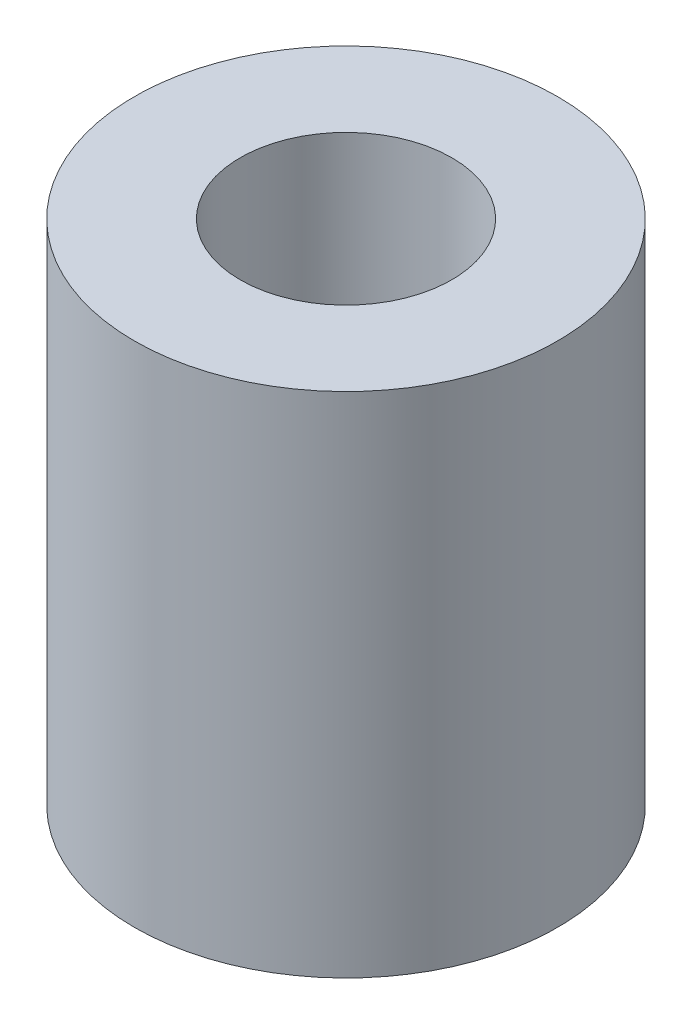
ISO-10303-21;
HEADER;
FILE_DESCRIPTION(('STEP AP214'),'2;1');
FILE_NAME('part.step','',(''),(''),'','','');
FILE_SCHEMA(('AUTOMOTIVE_DESIGN { 1 0 10303 214 1 1 1 1 }'));
ENDSEC;
DATA;
#1=APPLICATION_CONTEXT('core data for automotive mechanical design processes');
#2=APPLICATION_PROTOCOL_DEFINITION('international standard','automotive_design',2000,#1);
#3=PRODUCT_CONTEXT('',#1,'mechanical');
#4=PRODUCT('Part','Part','',(#3));
#5=PRODUCT_RELATED_PRODUCT_CATEGORY('part','',(#4));
#6=PRODUCT_DEFINITION_FORMATION('','',#4);
#7=PRODUCT_DEFINITION_CONTEXT('part definition',#1,'design');
#8=PRODUCT_DEFINITION('design','',#6,#7);
#9=PRODUCT_DEFINITION_SHAPE('','',#8);
#10=(LENGTH_UNIT() NAMED_UNIT(*) SI_UNIT(.MILLI.,.METRE.));
#11=(NAMED_UNIT(*) PLANE_ANGLE_UNIT() SI_UNIT($,.RADIAN.));
#12=(NAMED_UNIT(*) SI_UNIT($,.STERADIAN.) SOLID_ANGLE_UNIT());
#13=UNCERTAINTY_MEASURE_WITH_UNIT(LENGTH_MEASURE(1.E-05),#10,'distance_accuracy_value','');
#14=(GEOMETRIC_REPRESENTATION_CONTEXT(3) GLOBAL_UNCERTAINTY_ASSIGNED_CONTEXT((#13)) GLOBAL_UNIT_ASSIGNED_CONTEXT((#10,
#11,#12)) REPRESENTATION_CONTEXT('',''));
#15=CARTESIAN_POINT('',(0.,0.,0.));
#16=DIRECTION('',(0.,0.,1.));
#17=DIRECTION('',(1.,0.,0.));
#18=AXIS2_PLACEMENT_3D('',#15,#16,#17);
#19=CARTESIAN_POINT('',(0.,24.,0.));
#20=DIRECTION('',(0.,-1.,0.));
#21=DIRECTION('',(0.,0.,-1.));
#22=AXIS2_PLACEMENT_3D('',#19,#20,#21);
#23=CYLINDRICAL_SURFACE('',#22,10.);
#24=CARTESIAN_POINT('',(0.,24.,0.));
#25=DIRECTION('',(0.,1.,0.));
#26=DIRECTION('',(0.,0.,1.));
#27=AXIS2_PLACEMENT_3D('',#24,#25,#26);
#28=CIRCLE('',#27,10.);
#29=CARTESIAN_POINT('',(0.,24.,10.));
#30=VERTEX_POINT('',#29);
#31=EDGE_CURVE('E10',#30,#30,#28,.T.);
#32=ORIENTED_EDGE('',*,*,#31,.F.);
#33=EDGE_LOOP('',(#32));
#34=FACE_BOUND('',#33,.T.);
#35=CARTESIAN_POINT('',(0.,0.,0.));
#36=DIRECTION('',(0.,1.,0.));
#37=DIRECTION('',(0.,0.,1.));
#38=AXIS2_PLACEMENT_3D('',#35,#36,#37);
#39=CIRCLE('',#38,10.);
#40=CARTESIAN_POINT('',(0.,0.,10.));
#41=VERTEX_POINT('',#40);
#42=EDGE_CURVE('E37',#41,#41,#39,.T.);
#43=ORIENTED_EDGE('',*,*,#42,.T.);
#44=EDGE_LOOP('',(#43));
#45=FACE_BOUND('',#44,.T.);
#46=ADVANCED_FACE('F34',(#34,#45),#23,.T.);
#47=CARTESIAN_POINT('',(0.,24.,0.));
#48=DIRECTION('',(0.,1.,0.));
#49=DIRECTION('',(0.,0.,1.));
#50=AXIS2_PLACEMENT_3D('',#47,#48,#49);
#51=PLANE('',#50);
#52=CARTESIAN_POINT('',(0.,24.,0.));
#53=DIRECTION('',(0.,1.,0.));
#54=DIRECTION('',(0.,0.,1.));
#55=AXIS2_PLACEMENT_3D('',#52,#53,#54);
#56=CIRCLE('',#55,5.);
#57=CARTESIAN_POINT('',(0.,24.,5.));
#58=VERTEX_POINT('',#57);
#59=EDGE_CURVE('E46',#58,#58,#56,.T.);
#60=ORIENTED_EDGE('',*,*,#59,.F.);
#61=EDGE_LOOP('',(#60));
#62=FACE_BOUND('',#61,.T.);
#63=ORIENTED_EDGE('',*,*,#31,.T.);
#64=EDGE_LOOP('',(#63));
#65=FACE_BOUND('',#64,.T.);
#66=ADVANCED_FACE('F71',(#62,#65),#51,.T.);
#67=CARTESIAN_POINT('',(0.,0.,0.));
#68=DIRECTION('',(0.,1.,0.));
#69=DIRECTION('',(0.,0.,1.));
#70=AXIS2_PLACEMENT_3D('',#67,#68,#69);
#71=PLANE('',#70);
#72=CARTESIAN_POINT('',(0.,0.,0.));
#73=DIRECTION('',(0.,-1.,0.));
#74=DIRECTION('',(0.,0.,-1.));
#75=AXIS2_PLACEMENT_3D('',#72,#73,#74);
#76=CIRCLE('',#75,2.5);
#77=CARTESIAN_POINT('',(0.,0.,-2.5));
#78=VERTEX_POINT('',#77);
#79=EDGE_CURVE('E52',#78,#78,#76,.T.);
#80=ORIENTED_EDGE('',*,*,#79,.F.);
#81=EDGE_LOOP('',(#80));
#82=FACE_BOUND('',#81,.T.);
#83=ORIENTED_EDGE('',*,*,#42,.F.);
#84=EDGE_LOOP('',(#83));
#85=FACE_BOUND('',#84,.T.);
#86=ADVANCED_FACE('F67',(#82,#85),#71,.F.);
#87=CARTESIAN_POINT('',(0.,12.,0.));
#88=DIRECTION('',(0.,1.,0.));
#89=DIRECTION('',(0.,0.,1.));
#90=AXIS2_PLACEMENT_3D('',#87,#88,#89);
#91=CYLINDRICAL_SURFACE('',#90,5.);
#92=CARTESIAN_POINT('',(0.,12.,0.));
#93=DIRECTION('',(0.,1.,0.));
#94=DIRECTION('',(0.,0.,1.));
#95=AXIS2_PLACEMENT_3D('',#92,#93,#94);
#96=CIRCLE('',#95,5.);
#97=CARTESIAN_POINT('',(0.,12.,5.));
#98=VERTEX_POINT('',#97);
#99=EDGE_CURVE('E44',#98,#98,#96,.T.);
#100=ORIENTED_EDGE('',*,*,#99,.F.);
#101=EDGE_LOOP('',(#100));
#102=FACE_BOUND('',#101,.T.);
#103=ORIENTED_EDGE('',*,*,#59,.T.);
#104=EDGE_LOOP('',(#103));
#105=FACE_BOUND('',#104,.T.);
#106=ADVANCED_FACE('F70',(#102,#105),#91,.F.);
#107=CARTESIAN_POINT('',(0.,12.,0.));
#108=DIRECTION('',(0.,1.,0.));
#109=DIRECTION('',(0.,0.,1.));
#110=AXIS2_PLACEMENT_3D('',#107,#108,#109);
#111=PLANE('',#110);
#112=CARTESIAN_POINT('',(0.,12.,0.));
#113=DIRECTION('',(0.,-1.,0.));
#114=DIRECTION('',(0.,0.,-1.));
#115=AXIS2_PLACEMENT_3D('',#112,#113,#114);
#116=CIRCLE('',#115,2.5);
#117=CARTESIAN_POINT('',(0.,12.,-2.5));
#118=VERTEX_POINT('',#117);
#119=EDGE_CURVE('E49',#118,#118,#116,.T.);
#120=ORIENTED_EDGE('',*,*,#119,.T.);
#121=EDGE_LOOP('',(#120));
#122=FACE_BOUND('',#121,.T.);
#123=ORIENTED_EDGE('',*,*,#99,.T.);
#124=EDGE_LOOP('',(#123));
#125=FACE_BOUND('',#124,.T.);
#126=ADVANCED_FACE('F58',(#122,#125),#111,.T.);
#127=CARTESIAN_POINT('',(0.,12.,0.));
#128=DIRECTION('',(0.,-1.,0.));
#129=DIRECTION('',(0.,0.,-1.));
#130=AXIS2_PLACEMENT_3D('',#127,#128,#129);
#131=CYLINDRICAL_SURFACE('',#130,2.5);
#132=ORIENTED_EDGE('',*,*,#119,.F.);
#133=EDGE_LOOP('',(#132));
#134=FACE_BOUND('',#133,.T.);
#135=ORIENTED_EDGE('',*,*,#79,.T.);
#136=EDGE_LOOP('',(#135));
#137=FACE_BOUND('',#136,.T.);
#138=ADVANCED_FACE('F61',(#134,#137),#131,.F.);
#139=CLOSED_SHELL('',(#46,#66,#86,#106,#126,#138));
#140=MANIFOLD_SOLID_BREP('B2',#139);
#141=ADVANCED_BREP_SHAPE_REPRESENTATION('',(#18,#140),#14);
#142=SHAPE_DEFINITION_REPRESENTATION(#9,#141);
ENDSEC;
END-ISO-10303-21;
